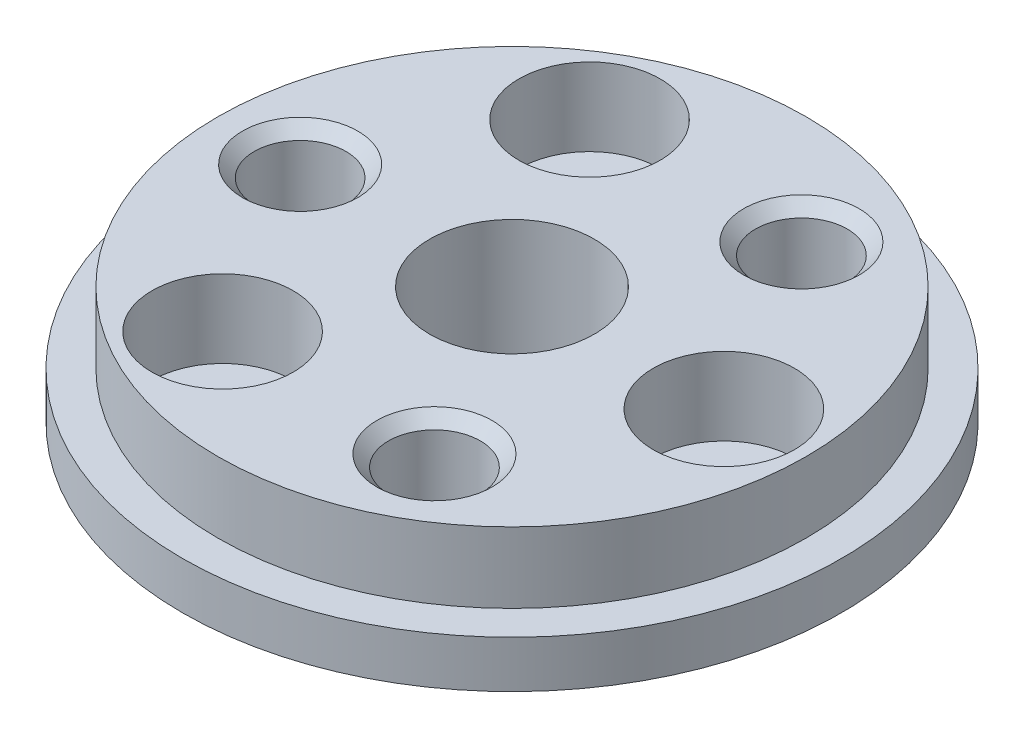
ISO-10303-21;
HEADER;
FILE_DESCRIPTION(('STEP AP214'),'2;1');
FILE_NAME('part.step','',(''),(''),'','','');
FILE_SCHEMA(('AUTOMOTIVE_DESIGN { 1 0 10303 214 1 1 1 1 }'));
ENDSEC;
DATA;
#1=APPLICATION_CONTEXT('core data for automotive mechanical design processes');
#2=APPLICATION_PROTOCOL_DEFINITION('international standard','automotive_design',2000,#1);
#3=PRODUCT_CONTEXT('',#1,'mechanical');
#4=PRODUCT('Part','Part','',(#3));
#5=PRODUCT_RELATED_PRODUCT_CATEGORY('part','',(#4));
#6=PRODUCT_DEFINITION_FORMATION('','',#4);
#7=PRODUCT_DEFINITION_CONTEXT('part definition',#1,'design');
#8=PRODUCT_DEFINITION('design','',#6,#7);
#9=PRODUCT_DEFINITION_SHAPE('','',#8);
#10=(LENGTH_UNIT() NAMED_UNIT(*) SI_UNIT(.MILLI.,.METRE.));
#11=(NAMED_UNIT(*) PLANE_ANGLE_UNIT() SI_UNIT($,.RADIAN.));
#12=(NAMED_UNIT(*) SI_UNIT($,.STERADIAN.) SOLID_ANGLE_UNIT());
#13=UNCERTAINTY_MEASURE_WITH_UNIT(LENGTH_MEASURE(1.E-05),#10,'distance_accuracy_value','');
#14=(GEOMETRIC_REPRESENTATION_CONTEXT(3) GLOBAL_UNCERTAINTY_ASSIGNED_CONTEXT((#13)) GLOBAL_UNIT_ASSIGNED_CONTEXT((#10,
#11,#12)) REPRESENTATION_CONTEXT('',''));
#15=CARTESIAN_POINT('',(0.,0.,0.));
#16=DIRECTION('',(0.,0.,1.));
#17=DIRECTION('',(1.,0.,0.));
#18=AXIS2_PLACEMENT_3D('',#15,#16,#17);
#19=CARTESIAN_POINT('',(-4.5,0.,-7.79422863405995));
#20=DIRECTION('',(0.,1.,0.));
#21=DIRECTION('',(0.,0.,1.));
#22=AXIS2_PLACEMENT_3D('',#19,#20,#21);
#23=CYLINDRICAL_SURFACE('',#22,1.6);
#24=CARTESIAN_POINT('',(-4.5,0.,-7.79422863405995));
#25=DIRECTION('',(0.,1.,0.));
#26=DIRECTION('',(0.,0.,1.));
#27=AXIS2_PLACEMENT_3D('',#24,#25,#26);
#28=CIRCLE('',#27,1.6);
#29=CARTESIAN_POINT('',(-4.5,0.,-6.19422863405994));
#30=VERTEX_POINT('',#29);
#31=EDGE_CURVE('E70',#30,#30,#28,.T.);
#32=ORIENTED_EDGE('',*,*,#31,.F.);
#33=EDGE_LOOP('',(#32));
#34=FACE_BOUND('',#33,.T.);
#35=CARTESIAN_POINT('',(-4.5,1.7,-7.79422863405995));
#36=DIRECTION('',(0.,1.,0.));
#37=DIRECTION('',(0.,0.,1.));
#38=AXIS2_PLACEMENT_3D('',#35,#36,#37);
#39=CIRCLE('',#38,1.6);
#40=CARTESIAN_POINT('',(-4.5,1.7,-6.19422863405994));
#41=VERTEX_POINT('',#40);
#42=EDGE_CURVE('E67',#41,#41,#39,.F.);
#43=ORIENTED_EDGE('',*,*,#42,.F.);
#44=EDGE_LOOP('',(#43));
#45=FACE_BOUND('',#44,.T.);
#46=ADVANCED_FACE('F39',(#34,#45),#23,.F.);
#47=CARTESIAN_POINT('',(-4.5,0.,7.79422863405995));
#48=DIRECTION('',(0.,1.,0.));
#49=DIRECTION('',(0.,0.,1.));
#50=AXIS2_PLACEMENT_3D('',#47,#48,#49);
#51=CYLINDRICAL_SURFACE('',#50,1.6);
#52=CARTESIAN_POINT('',(-4.5,0.,7.79422863405995));
#53=DIRECTION('',(0.,1.,0.));
#54=DIRECTION('',(0.,0.,1.));
#55=AXIS2_PLACEMENT_3D('',#52,#53,#54);
#56=CIRCLE('',#55,1.6);
#57=CARTESIAN_POINT('',(-4.5,0.,9.39422863405995));
#58=VERTEX_POINT('',#57);
#59=EDGE_CURVE('E92',#58,#58,#56,.T.);
#60=ORIENTED_EDGE('',*,*,#59,.F.);
#61=EDGE_LOOP('',(#60));
#62=FACE_BOUND('',#61,.T.);
#63=CARTESIAN_POINT('',(-4.5,1.7,7.79422863405995));
#64=DIRECTION('',(0.,1.,0.));
#65=DIRECTION('',(0.,0.,1.));
#66=AXIS2_PLACEMENT_3D('',#63,#64,#65);
#67=CIRCLE('',#66,1.6);
#68=CARTESIAN_POINT('',(-4.5,1.7,9.39422863405995));
#69=VERTEX_POINT('',#68);
#70=EDGE_CURVE('E71',#69,#69,#67,.F.);
#71=ORIENTED_EDGE('',*,*,#70,.F.);
#72=EDGE_LOOP('',(#71));
#73=FACE_BOUND('',#72,.T.);
#74=ADVANCED_FACE('F182',(#62,#73),#51,.F.);
#75=CARTESIAN_POINT('',(9.,0.,0.));
#76=DIRECTION('',(0.,1.,0.));
#77=DIRECTION('',(0.,0.,1.));
#78=AXIS2_PLACEMENT_3D('',#75,#76,#77);
#79=CYLINDRICAL_SURFACE('',#78,1.6);
#80=CARTESIAN_POINT('',(9.,0.,0.));
#81=DIRECTION('',(0.,1.,0.));
#82=DIRECTION('',(0.,0.,1.));
#83=AXIS2_PLACEMENT_3D('',#80,#81,#82);
#84=CIRCLE('',#83,1.6);
#85=CARTESIAN_POINT('',(9.,0.,1.6));
#86=VERTEX_POINT('',#85);
#87=EDGE_CURVE('E89',#86,#86,#84,.T.);
#88=ORIENTED_EDGE('',*,*,#87,.F.);
#89=EDGE_LOOP('',(#88));
#90=FACE_BOUND('',#89,.T.);
#91=CARTESIAN_POINT('',(9.,1.7,0.));
#92=DIRECTION('',(0.,1.,0.));
#93=DIRECTION('',(0.,0.,1.));
#94=AXIS2_PLACEMENT_3D('',#91,#92,#93);
#95=CIRCLE('',#94,1.6);
#96=CARTESIAN_POINT('',(9.,1.7,1.6));
#97=VERTEX_POINT('',#96);
#98=EDGE_CURVE('E74',#97,#97,#95,.F.);
#99=ORIENTED_EDGE('',*,*,#98,.F.);
#100=EDGE_LOOP('',(#99));
#101=FACE_BOUND('',#100,.T.);
#102=ADVANCED_FACE('F173',(#90,#101),#79,.F.);
#103=CARTESIAN_POINT('',(0.,2.,0.));
#104=DIRECTION('',(0.,-1.,0.));
#105=DIRECTION('',(0.,0.,-1.));
#106=AXIS2_PLACEMENT_3D('',#103,#104,#105);
#107=CYLINDRICAL_SURFACE('',#106,14.);
#108=CARTESIAN_POINT('',(0.,2.,0.));
#109=DIRECTION('',(0.,1.,0.));
#110=DIRECTION('',(0.,0.,1.));
#111=AXIS2_PLACEMENT_3D('',#108,#109,#110);
#112=CIRCLE('',#111,14.);
#113=CARTESIAN_POINT('',(0.,2.,14.));
#114=VERTEX_POINT('',#113);
#115=EDGE_CURVE('E81',#114,#114,#112,.T.);
#116=ORIENTED_EDGE('',*,*,#115,.F.);
#117=EDGE_LOOP('',(#116));
#118=FACE_BOUND('',#117,.T.);
#119=CARTESIAN_POINT('',(0.,0.,0.));
#120=DIRECTION('',(0.,1.,0.));
#121=DIRECTION('',(0.,0.,1.));
#122=AXIS2_PLACEMENT_3D('',#119,#120,#121);
#123=CIRCLE('',#122,14.);
#124=CARTESIAN_POINT('',(0.,0.,14.));
#125=VERTEX_POINT('',#124);
#126=EDGE_CURVE('E78',#125,#125,#123,.T.);
#127=ORIENTED_EDGE('',*,*,#126,.T.);
#128=EDGE_LOOP('',(#127));
#129=FACE_BOUND('',#128,.T.);
#130=ADVANCED_FACE('F167',(#118,#129),#107,.T.);
#131=CARTESIAN_POINT('',(0.,2.,0.));
#132=DIRECTION('',(0.,1.,0.));
#133=DIRECTION('',(0.,0.,1.));
#134=AXIS2_PLACEMENT_3D('',#131,#132,#133);
#135=PLANE('',#134);
#136=CARTESIAN_POINT('',(0.,2.,0.));
#137=DIRECTION('',(0.,1.,0.));
#138=DIRECTION('',(0.,0.,1.));
#139=AXIS2_PLACEMENT_3D('',#136,#137,#138);
#140=CIRCLE('',#139,12.5);
#141=CARTESIAN_POINT('',(0.,2.,12.5));
#142=VERTEX_POINT('',#141);
#143=EDGE_CURVE('E66',#142,#142,#140,.T.);
#144=ORIENTED_EDGE('',*,*,#143,.F.);
#145=EDGE_LOOP('',(#144));
#146=FACE_BOUND('',#145,.T.);
#147=ORIENTED_EDGE('',*,*,#115,.T.);
#148=EDGE_LOOP('',(#147));
#149=FACE_BOUND('',#148,.T.);
#150=ADVANCED_FACE('F164',(#146,#149),#135,.T.);
#151=CARTESIAN_POINT('',(0.,0.,0.));
#152=DIRECTION('',(0.,1.,0.));
#153=DIRECTION('',(0.,0.,1.));
#154=AXIS2_PLACEMENT_3D('',#151,#152,#153);
#155=PLANE('',#154);
#156=CARTESIAN_POINT('',(0.,0.,0.));
#157=DIRECTION('',(0.,1.,0.));
#158=DIRECTION('',(0.,0.,1.));
#159=AXIS2_PLACEMENT_3D('',#156,#157,#158);
#160=CIRCLE('',#159,3.5);
#161=CARTESIAN_POINT('',(0.,0.,3.5));
#162=VERTEX_POINT('',#161);
#163=EDGE_CURVE('E119',#162,#162,#160,.T.);
#164=ORIENTED_EDGE('',*,*,#163,.T.);
#165=EDGE_LOOP('',(#164));
#166=FACE_BOUND('',#165,.T.);
#167=ORIENTED_EDGE('',*,*,#87,.T.);
#168=EDGE_LOOP('',(#167));
#169=FACE_BOUND('',#168,.T.);
#170=ORIENTED_EDGE('',*,*,#59,.T.);
#171=EDGE_LOOP('',(#170));
#172=FACE_BOUND('',#171,.T.);
#173=ORIENTED_EDGE('',*,*,#31,.T.);
#174=EDGE_LOOP('',(#173));
#175=FACE_BOUND('',#174,.T.);
#176=ORIENTED_EDGE('',*,*,#126,.F.);
#177=EDGE_LOOP('',(#176));
#178=FACE_BOUND('',#177,.T.);
#179=ADVANCED_FACE('F130',(#166,#169,#172,#175,#178),#155,.F.);
#180=CARTESIAN_POINT('',(0.,5.,0.));
#181=DIRECTION('',(0.,-1.,0.));
#182=DIRECTION('',(0.,0.,-1.));
#183=AXIS2_PLACEMENT_3D('',#180,#181,#182);
#184=CYLINDRICAL_SURFACE('',#183,12.5);
#185=CARTESIAN_POINT('',(0.,5.,0.));
#186=DIRECTION('',(0.,1.,0.));
#187=DIRECTION('',(0.,0.,1.));
#188=AXIS2_PLACEMENT_3D('',#185,#186,#187);
#189=CIRCLE('',#188,12.5);
#190=CARTESIAN_POINT('',(0.,5.,12.5));
#191=VERTEX_POINT('',#190);
#192=EDGE_CURVE('E82',#191,#191,#189,.T.);
#193=ORIENTED_EDGE('',*,*,#192,.F.);
#194=EDGE_LOOP('',(#193));
#195=FACE_BOUND('',#194,.T.);
#196=ORIENTED_EDGE('',*,*,#143,.T.);
#197=EDGE_LOOP('',(#196));
#198=FACE_BOUND('',#197,.T.);
#199=ADVANCED_FACE('F143',(#195,#198),#184,.T.);
#200=CARTESIAN_POINT('',(0.,5.,0.));
#201=DIRECTION('',(0.,1.,0.));
#202=DIRECTION('',(0.,0.,1.));
#203=AXIS2_PLACEMENT_3D('',#200,#201,#202);
#204=PLANE('',#203);
#205=CARTESIAN_POINT('',(0.,5.,0.));
#206=DIRECTION('',(0.,1.,0.));
#207=DIRECTION('',(0.,0.,1.));
#208=AXIS2_PLACEMENT_3D('',#205,#206,#207);
#209=CIRCLE('',#208,3.5);
#210=CARTESIAN_POINT('',(0.,5.,3.5));
#211=VERTEX_POINT('',#210);
#212=EDGE_CURVE('E124',#211,#211,#209,.T.);
#213=ORIENTED_EDGE('',*,*,#212,.F.);
#214=EDGE_LOOP('',(#213));
#215=FACE_BOUND('',#214,.T.);
#216=CARTESIAN_POINT('',(4.50000000000004,5.,-7.79422863405993));
#217=DIRECTION('',(0.,1.,0.));
#218=DIRECTION('',(0.,0.,1.));
#219=AXIS2_PLACEMENT_3D('',#216,#217,#218);
#220=CIRCLE('',#219,2.45);
#221=CARTESIAN_POINT('',(4.50000000000004,5.,-5.34422863405992));
#222=VERTEX_POINT('',#221);
#223=EDGE_CURVE('E51',#222,#222,#220,.F.);
#224=ORIENTED_EDGE('',*,*,#223,.T.);
#225=EDGE_LOOP('',(#224));
#226=FACE_BOUND('',#225,.T.);
#227=CARTESIAN_POINT('',(-9.,5.,0.));
#228=DIRECTION('',(0.,1.,0.));
#229=DIRECTION('',(0.,0.,1.));
#230=AXIS2_PLACEMENT_3D('',#227,#228,#229);
#231=CIRCLE('',#230,2.45);
#232=CARTESIAN_POINT('',(-9.,5.,2.44999999999997));
#233=VERTEX_POINT('',#232);
#234=EDGE_CURVE('E55',#233,#233,#231,.F.);
#235=ORIENTED_EDGE('',*,*,#234,.T.);
#236=EDGE_LOOP('',(#235));
#237=FACE_BOUND('',#236,.T.);
#238=CARTESIAN_POINT('',(4.49999999999997,5.,7.79422863405997));
#239=DIRECTION('',(0.,1.,0.));
#240=DIRECTION('',(0.,0.,1.));
#241=AXIS2_PLACEMENT_3D('',#238,#239,#240);
#242=CIRCLE('',#241,2.45);
#243=CARTESIAN_POINT('',(4.49999999999997,5.,10.24422863406));
#244=VERTEX_POINT('',#243);
#245=EDGE_CURVE('E60',#244,#244,#242,.F.);
#246=ORIENTED_EDGE('',*,*,#245,.T.);
#247=EDGE_LOOP('',(#246));
#248=FACE_BOUND('',#247,.T.);
#249=CARTESIAN_POINT('',(9.,5.,0.));
#250=DIRECTION('',(0.,1.,0.));
#251=DIRECTION('',(0.,0.,1.));
#252=AXIS2_PLACEMENT_3D('',#249,#250,#251);
#253=CIRCLE('',#252,3.);
#254=CARTESIAN_POINT('',(9.,5.,3.));
#255=VERTEX_POINT('',#254);
#256=EDGE_CURVE('E110',#255,#255,#253,.T.);
#257=ORIENTED_EDGE('',*,*,#256,.F.);
#258=EDGE_LOOP('',(#257));
#259=FACE_BOUND('',#258,.T.);
#260=CARTESIAN_POINT('',(-4.5,5.,-7.79422863405995));
#261=DIRECTION('',(0.,1.,0.));
#262=DIRECTION('',(0.,0.,1.));
#263=AXIS2_PLACEMENT_3D('',#260,#261,#262);
#264=CIRCLE('',#263,3.);
#265=CARTESIAN_POINT('',(-4.5,5.,-4.79422863405994));
#266=VERTEX_POINT('',#265);
#267=EDGE_CURVE('E104',#266,#266,#264,.T.);
#268=ORIENTED_EDGE('',*,*,#267,.F.);
#269=EDGE_LOOP('',(#268));
#270=FACE_BOUND('',#269,.T.);
#271=CARTESIAN_POINT('',(-4.5,5.,7.79422863405995));
#272=DIRECTION('',(0.,1.,0.));
#273=DIRECTION('',(0.,0.,1.));
#274=AXIS2_PLACEMENT_3D('',#271,#272,#273);
#275=CIRCLE('',#274,3.);
#276=CARTESIAN_POINT('',(-4.5,5.,10.7942286340599));
#277=VERTEX_POINT('',#276);
#278=EDGE_CURVE('E97',#277,#277,#275,.T.);
#279=ORIENTED_EDGE('',*,*,#278,.F.);
#280=EDGE_LOOP('',(#279));
#281=FACE_BOUND('',#280,.T.);
#282=ORIENTED_EDGE('',*,*,#192,.T.);
#283=EDGE_LOOP('',(#282));
#284=FACE_BOUND('',#283,.T.);
#285=ADVANCED_FACE('F139',(#215,#226,#237,#248,#259,#270,#281,#284),#204,.T.);
#286=CARTESIAN_POINT('',(9.,1.7,0.));
#287=DIRECTION('',(0.,1.,0.));
#288=DIRECTION('',(0.,0.,1.));
#289=AXIS2_PLACEMENT_3D('',#286,#287,#288);
#290=PLANE('',#289);
#291=CARTESIAN_POINT('',(9.,1.7,0.));
#292=DIRECTION('',(0.,1.,0.));
#293=DIRECTION('',(0.,0.,1.));
#294=AXIS2_PLACEMENT_3D('',#291,#292,#293);
#295=CIRCLE('',#294,3.);
#296=CARTESIAN_POINT('',(9.,1.7,3.));
#297=VERTEX_POINT('',#296);
#298=EDGE_CURVE('E77',#297,#297,#295,.T.);
#299=ORIENTED_EDGE('',*,*,#298,.T.);
#300=EDGE_LOOP('',(#299));
#301=FACE_BOUND('',#300,.T.);
#302=ORIENTED_EDGE('',*,*,#98,.T.);
#303=EDGE_LOOP('',(#302));
#304=FACE_BOUND('',#303,.T.);
#305=ADVANCED_FACE('F142',(#301,#304),#290,.T.);
#306=CARTESIAN_POINT('',(9.,1.7,0.));
#307=DIRECTION('',(0.,1.,0.));
#308=DIRECTION('',(0.,0.,1.));
#309=AXIS2_PLACEMENT_3D('',#306,#307,#308);
#310=CYLINDRICAL_SURFACE('',#309,3.);
#311=ORIENTED_EDGE('',*,*,#298,.F.);
#312=EDGE_LOOP('',(#311));
#313=FACE_BOUND('',#312,.T.);
#314=ORIENTED_EDGE('',*,*,#256,.T.);
#315=EDGE_LOOP('',(#314));
#316=FACE_BOUND('',#315,.T.);
#317=ADVANCED_FACE('F204',(#313,#316),#310,.F.);
#318=CARTESIAN_POINT('',(-4.5,1.7,7.79422863405995));
#319=DIRECTION('',(0.,1.,0.));
#320=DIRECTION('',(0.,0.,1.));
#321=AXIS2_PLACEMENT_3D('',#318,#319,#320);
#322=PLANE('',#321);
#323=CARTESIAN_POINT('',(-4.5,1.7,7.79422863405995));
#324=DIRECTION('',(0.,1.,0.));
#325=DIRECTION('',(0.,0.,1.));
#326=AXIS2_PLACEMENT_3D('',#323,#324,#325);
#327=CIRCLE('',#326,3.);
#328=CARTESIAN_POINT('',(-4.5,1.7,10.7942286340599));
#329=VERTEX_POINT('',#328);
#330=EDGE_CURVE('E100',#329,#329,#327,.T.);
#331=ORIENTED_EDGE('',*,*,#330,.T.);
#332=EDGE_LOOP('',(#331));
#333=FACE_BOUND('',#332,.T.);
#334=ORIENTED_EDGE('',*,*,#70,.T.);
#335=EDGE_LOOP('',(#334));
#336=FACE_BOUND('',#335,.T.);
#337=ADVANCED_FACE('F200',(#333,#336),#322,.T.);
#338=CARTESIAN_POINT('',(-4.5,1.7,7.79422863405995));
#339=DIRECTION('',(0.,1.,0.));
#340=DIRECTION('',(0.,0.,1.));
#341=AXIS2_PLACEMENT_3D('',#338,#339,#340);
#342=CYLINDRICAL_SURFACE('',#341,3.);
#343=ORIENTED_EDGE('',*,*,#330,.F.);
#344=EDGE_LOOP('',(#343));
#345=FACE_BOUND('',#344,.T.);
#346=ORIENTED_EDGE('',*,*,#278,.T.);
#347=EDGE_LOOP('',(#346));
#348=FACE_BOUND('',#347,.T.);
#349=ADVANCED_FACE('F196',(#345,#348),#342,.F.);
#350=CARTESIAN_POINT('',(-4.5,1.7,-7.79422863405995));
#351=DIRECTION('',(0.,1.,0.));
#352=DIRECTION('',(0.,0.,1.));
#353=AXIS2_PLACEMENT_3D('',#350,#351,#352);
#354=PLANE('',#353);
#355=CARTESIAN_POINT('',(-4.5,1.7,-7.79422863405995));
#356=DIRECTION('',(0.,1.,0.));
#357=DIRECTION('',(0.,0.,1.));
#358=AXIS2_PLACEMENT_3D('',#355,#356,#357);
#359=CIRCLE('',#358,3.);
#360=CARTESIAN_POINT('',(-4.5,1.7,-4.79422863405994));
#361=VERTEX_POINT('',#360);
#362=EDGE_CURVE('E107',#361,#361,#359,.T.);
#363=ORIENTED_EDGE('',*,*,#362,.T.);
#364=EDGE_LOOP('',(#363));
#365=FACE_BOUND('',#364,.T.);
#366=ORIENTED_EDGE('',*,*,#42,.T.);
#367=EDGE_LOOP('',(#366));
#368=FACE_BOUND('',#367,.T.);
#369=ADVANCED_FACE('F199',(#365,#368),#354,.T.);
#370=CARTESIAN_POINT('',(-4.5,1.7,-7.79422863405995));
#371=DIRECTION('',(0.,1.,0.));
#372=DIRECTION('',(0.,0.,1.));
#373=AXIS2_PLACEMENT_3D('',#370,#371,#372);
#374=CYLINDRICAL_SURFACE('',#373,3.);
#375=ORIENTED_EDGE('',*,*,#362,.F.);
#376=EDGE_LOOP('',(#375));
#377=FACE_BOUND('',#376,.T.);
#378=ORIENTED_EDGE('',*,*,#267,.T.);
#379=EDGE_LOOP('',(#378));
#380=FACE_BOUND('',#379,.T.);
#381=ADVANCED_FACE('F206',(#377,#380),#374,.F.);
#382=CARTESIAN_POINT('',(-9.,1.8,0.));
#383=DIRECTION('',(0.,1.,0.));
#384=DIRECTION('',(0.,0.,1.));
#385=AXIS2_PLACEMENT_3D('',#382,#383,#384);
#386=CYLINDRICAL_SURFACE('',#385,1.95);
#387=CARTESIAN_POINT('',(-9.,4.5,0.));
#388=DIRECTION('',(0.,1.,0.));
#389=DIRECTION('',(0.,0.,1.));
#390=AXIS2_PLACEMENT_3D('',#387,#388,#389);
#391=CIRCLE('',#390,1.95);
#392=CARTESIAN_POINT('',(-9.,4.5,1.94999999999997));
#393=VERTEX_POINT('',#392);
#394=EDGE_CURVE('E47',#393,#393,#391,.T.);
#395=ORIENTED_EDGE('',*,*,#394,.T.);
#396=EDGE_LOOP('',(#395));
#397=FACE_BOUND('',#396,.T.);
#398=CARTESIAN_POINT('',(-9.,1.8,0.));
#399=DIRECTION('',(0.,1.,0.));
#400=DIRECTION('',(0.,0.,1.));
#401=AXIS2_PLACEMENT_3D('',#398,#399,#400);
#402=CIRCLE('',#401,1.95);
#403=CARTESIAN_POINT('',(-9.,1.8,1.94999999999997));
#404=VERTEX_POINT('',#403);
#405=EDGE_CURVE('E115',#404,#404,#402,.T.);
#406=ORIENTED_EDGE('',*,*,#405,.F.);
#407=EDGE_LOOP('',(#406));
#408=FACE_BOUND('',#407,.T.);
#409=ADVANCED_FACE('F209',(#397,#408),#386,.F.);
#410=CARTESIAN_POINT('',(-9.,1.8,0.));
#411=DIRECTION('',(0.,1.,0.));
#412=DIRECTION('',(0.,0.,1.));
#413=AXIS2_PLACEMENT_3D('',#410,#411,#412);
#414=PLANE('',#413);
#415=ORIENTED_EDGE('',*,*,#405,.T.);
#416=EDGE_LOOP('',(#415));
#417=FACE_BOUND('',#416,.T.);
#418=ADVANCED_FACE('F222',(#417),#414,.T.);
#419=CARTESIAN_POINT('',(4.49999999999997,1.8,7.79422863405997));
#420=DIRECTION('',(0.,1.,0.));
#421=DIRECTION('',(0.,0.,1.));
#422=AXIS2_PLACEMENT_3D('',#419,#420,#421);
#423=CYLINDRICAL_SURFACE('',#422,1.95);
#424=CARTESIAN_POINT('',(4.49999999999997,4.5,7.79422863405997));
#425=DIRECTION('',(0.,1.,0.));
#426=DIRECTION('',(0.,0.,1.));
#427=AXIS2_PLACEMENT_3D('',#424,#425,#426);
#428=CIRCLE('',#427,1.95);
#429=CARTESIAN_POINT('',(4.49999999999997,4.5,9.74422863405997));
#430=VERTEX_POINT('',#429);
#431=EDGE_CURVE('E10',#430,#430,#428,.T.);
#432=ORIENTED_EDGE('',*,*,#431,.T.);
#433=EDGE_LOOP('',(#432));
#434=FACE_BOUND('',#433,.T.);
#435=CARTESIAN_POINT('',(4.49999999999997,1.8,7.79422863405997));
#436=DIRECTION('',(0.,1.,0.));
#437=DIRECTION('',(0.,0.,1.));
#438=AXIS2_PLACEMENT_3D('',#435,#436,#437);
#439=CIRCLE('',#438,1.95);
#440=CARTESIAN_POINT('',(4.49999999999997,1.8,9.74422863405997));
#441=VERTEX_POINT('',#440);
#442=EDGE_CURVE('E118',#441,#441,#439,.T.);
#443=ORIENTED_EDGE('',*,*,#442,.F.);
#444=EDGE_LOOP('',(#443));
#445=FACE_BOUND('',#444,.T.);
#446=ADVANCED_FACE('F225',(#434,#445),#423,.F.);
#447=CARTESIAN_POINT('',(4.49999999999997,1.8,7.79422863405997));
#448=DIRECTION('',(0.,1.,0.));
#449=DIRECTION('',(0.,0.,1.));
#450=AXIS2_PLACEMENT_3D('',#447,#448,#449);
#451=PLANE('',#450);
#452=ORIENTED_EDGE('',*,*,#442,.T.);
#453=EDGE_LOOP('',(#452));
#454=FACE_BOUND('',#453,.T.);
#455=ADVANCED_FACE('F229',(#454),#451,.T.);
#456=CARTESIAN_POINT('',(4.50000000000004,1.8,-7.79422863405993));
#457=DIRECTION('',(0.,1.,0.));
#458=DIRECTION('',(0.,0.,1.));
#459=AXIS2_PLACEMENT_3D('',#456,#457,#458);
#460=CYLINDRICAL_SURFACE('',#459,1.95);
#461=CARTESIAN_POINT('',(4.50000000000004,4.5,-7.79422863405993));
#462=DIRECTION('',(0.,1.,0.));
#463=DIRECTION('',(0.,0.,1.));
#464=AXIS2_PLACEMENT_3D('',#461,#462,#463);
#465=CIRCLE('',#464,1.95);
#466=CARTESIAN_POINT('',(4.50000000000004,4.5,-5.84422863405993));
#467=VERTEX_POINT('',#466);
#468=EDGE_CURVE('E63',#467,#467,#465,.T.);
#469=ORIENTED_EDGE('',*,*,#468,.T.);
#470=EDGE_LOOP('',(#469));
#471=FACE_BOUND('',#470,.T.);
#472=CARTESIAN_POINT('',(4.50000000000004,1.8,-7.79422863405993));
#473=DIRECTION('',(0.,1.,0.));
#474=DIRECTION('',(0.,0.,1.));
#475=AXIS2_PLACEMENT_3D('',#472,#473,#474);
#476=CIRCLE('',#475,1.95);
#477=CARTESIAN_POINT('',(4.50000000000004,1.8,-5.84422863405993));
#478=VERTEX_POINT('',#477);
#479=EDGE_CURVE('E101',#478,#478,#476,.T.);
#480=ORIENTED_EDGE('',*,*,#479,.F.);
#481=EDGE_LOOP('',(#480));
#482=FACE_BOUND('',#481,.T.);
#483=ADVANCED_FACE('F232',(#471,#482),#460,.F.);
#484=CARTESIAN_POINT('',(4.50000000000004,1.8,-7.79422863405993));
#485=DIRECTION('',(0.,1.,0.));
#486=DIRECTION('',(0.,0.,1.));
#487=AXIS2_PLACEMENT_3D('',#484,#485,#486);
#488=PLANE('',#487);
#489=ORIENTED_EDGE('',*,*,#479,.T.);
#490=EDGE_LOOP('',(#489));
#491=FACE_BOUND('',#490,.T.);
#492=ADVANCED_FACE('F236',(#491),#488,.T.);
#493=CARTESIAN_POINT('',(4.50000000000004,4.5,-7.79422863405993));
#494=DIRECTION('',(0.,1.,0.));
#495=DIRECTION('',(0.,0.,1.));
#496=AXIS2_PLACEMENT_3D('',#493,#494,#495);
#497=CONICAL_SURFACE('',#496,1.95,0.785398163397448);
#498=ORIENTED_EDGE('',*,*,#223,.F.);
#499=EDGE_LOOP('',(#498));
#500=FACE_BOUND('',#499,.T.);
#501=ORIENTED_EDGE('',*,*,#468,.F.);
#502=EDGE_LOOP('',(#501));
#503=FACE_BOUND('',#502,.T.);
#504=ADVANCED_FACE('F239',(#500,#503),#497,.F.);
#505=CARTESIAN_POINT('',(-9.,4.5,0.));
#506=DIRECTION('',(0.,1.,0.));
#507=DIRECTION('',(0.,0.,1.));
#508=AXIS2_PLACEMENT_3D('',#505,#506,#507);
#509=CONICAL_SURFACE('',#508,1.95,0.785398163397449);
#510=ORIENTED_EDGE('',*,*,#234,.F.);
#511=EDGE_LOOP('',(#510));
#512=FACE_BOUND('',#511,.T.);
#513=ORIENTED_EDGE('',*,*,#394,.F.);
#514=EDGE_LOOP('',(#513));
#515=FACE_BOUND('',#514,.T.);
#516=ADVANCED_FACE('F244',(#512,#515),#509,.F.);
#517=CARTESIAN_POINT('',(4.49999999999997,4.5,7.79422863405997));
#518=DIRECTION('',(0.,1.,0.));
#519=DIRECTION('',(0.,0.,1.));
#520=AXIS2_PLACEMENT_3D('',#517,#518,#519);
#521=CONICAL_SURFACE('',#520,1.95,0.785398163397449);
#522=ORIENTED_EDGE('',*,*,#245,.F.);
#523=EDGE_LOOP('',(#522));
#524=FACE_BOUND('',#523,.T.);
#525=ORIENTED_EDGE('',*,*,#431,.F.);
#526=EDGE_LOOP('',(#525));
#527=FACE_BOUND('',#526,.T.);
#528=ADVANCED_FACE('F42',(#524,#527),#521,.F.);
#529=CARTESIAN_POINT('',(0.,0.,0.));
#530=DIRECTION('',(0.,1.,0.));
#531=DIRECTION('',(0.,0.,1.));
#532=AXIS2_PLACEMENT_3D('',#529,#530,#531);
#533=CYLINDRICAL_SURFACE('',#532,3.5);
#534=ORIENTED_EDGE('',*,*,#163,.F.);
#535=EDGE_LOOP('',(#534));
#536=FACE_BOUND('',#535,.T.);
#537=ORIENTED_EDGE('',*,*,#212,.T.);
#538=EDGE_LOOP('',(#537));
#539=FACE_BOUND('',#538,.T.);
#540=ADVANCED_FACE('F133',(#536,#539),#533,.F.);
#541=CLOSED_SHELL('',(#46,#74,#102,#130,#150,#179,#199,#285,#305,#317,#337,#349,#369,#381,#409,
#418,#446,#455,#483,#492,#504,#516,#528,#540));
#542=MANIFOLD_SOLID_BREP('B2',#541);
#543=ADVANCED_BREP_SHAPE_REPRESENTATION('',(#18,#542),#14);
#544=SHAPE_DEFINITION_REPRESENTATION(#9,#543);
ENDSEC;
END-ISO-10303-21;
